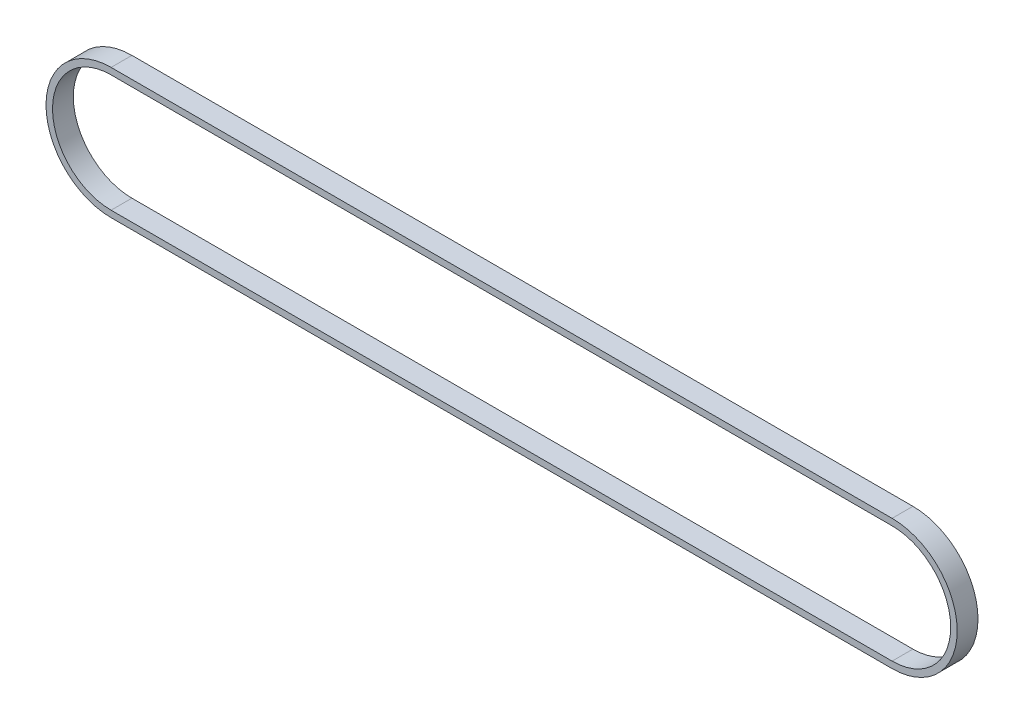
ISO-10303-21;
HEADER;
FILE_DESCRIPTION(('STEP AP214'),'2;1');
FILE_NAME('part.step','',(''),(''),'','','');
FILE_SCHEMA(('AUTOMOTIVE_DESIGN { 1 0 10303 214 1 1 1 1 }'));
ENDSEC;
DATA;
#1=APPLICATION_CONTEXT('core data for automotive mechanical design processes');
#2=APPLICATION_PROTOCOL_DEFINITION('international standard','automotive_design',2000,#1);
#3=PRODUCT_CONTEXT('',#1,'mechanical');
#4=PRODUCT('Part','Part','',(#3));
#5=PRODUCT_RELATED_PRODUCT_CATEGORY('part','',(#4));
#6=PRODUCT_DEFINITION_FORMATION('','',#4);
#7=PRODUCT_DEFINITION_CONTEXT('part definition',#1,'design');
#8=PRODUCT_DEFINITION('design','',#6,#7);
#9=PRODUCT_DEFINITION_SHAPE('','',#8);
#10=(LENGTH_UNIT() NAMED_UNIT(*) SI_UNIT(.MILLI.,.METRE.));
#11=(NAMED_UNIT(*) PLANE_ANGLE_UNIT() SI_UNIT($,.RADIAN.));
#12=(NAMED_UNIT(*) SI_UNIT($,.STERADIAN.) SOLID_ANGLE_UNIT());
#13=UNCERTAINTY_MEASURE_WITH_UNIT(LENGTH_MEASURE(1.E-05),#10,'distance_accuracy_value','');
#14=(GEOMETRIC_REPRESENTATION_CONTEXT(3) GLOBAL_UNCERTAINTY_ASSIGNED_CONTEXT((#13)) GLOBAL_UNIT_ASSIGNED_CONTEXT((#10,
#11,#12)) REPRESENTATION_CONTEXT('',''));
#15=CARTESIAN_POINT('',(0.,0.,0.));
#16=DIRECTION('',(0.,0.,1.));
#17=DIRECTION('',(1.,0.,0.));
#18=AXIS2_PLACEMENT_3D('',#15,#16,#17);
#19=CARTESIAN_POINT('',(-75.,0.,2.));
#20=DIRECTION('',(0.,0.,1.));
#21=DIRECTION('',(1.,0.,0.));
#22=AXIS2_PLACEMENT_3D('',#19,#20,#21);
#23=PLANE('',#22);
#24=CARTESIAN_POINT('',(-75.,0.,2.));
#25=DIRECTION('',(0.,0.,1.));
#26=DIRECTION('',(1.,0.,0.));
#27=AXIS2_PLACEMENT_3D('',#24,#25,#26);
#28=CIRCLE('',#27,12.5);
#29=CARTESIAN_POINT('',(-75.,12.5,2.));
#30=VERTEX_POINT('',#29);
#31=CARTESIAN_POINT('',(-75.,-12.5,2.));
#32=VERTEX_POINT('',#31);
#33=EDGE_CURVE('E136',#30,#32,#28,.T.);
#34=ORIENTED_EDGE('',*,*,#33,.T.);
#35=DIRECTION('',(1.,0.,0.));
#36=VECTOR('',#35,1.);
#37=CARTESIAN_POINT('',(-75.,-12.5,2.));
#38=LINE('',#37,#36);
#39=CARTESIAN_POINT('',(75.,-12.5,2.));
#40=VERTEX_POINT('',#39);
#41=EDGE_CURVE('E139',#32,#40,#38,.T.);
#42=ORIENTED_EDGE('',*,*,#41,.T.);
#43=CARTESIAN_POINT('',(75.,0.,2.));
#44=DIRECTION('',(0.,0.,1.));
#45=DIRECTION('',(1.,0.,0.));
#46=AXIS2_PLACEMENT_3D('',#43,#44,#45);
#47=CIRCLE('',#46,12.5);
#48=CARTESIAN_POINT('',(75.,12.5000000000001,2.));
#49=VERTEX_POINT('',#48);
#50=EDGE_CURVE('E142',#40,#49,#47,.T.);
#51=ORIENTED_EDGE('',*,*,#50,.T.);
#52=DIRECTION('',(-1.,0.,0.));
#53=VECTOR('',#52,1.);
#54=CARTESIAN_POINT('',(-75.,12.5,2.));
#55=LINE('',#54,#53);
#56=EDGE_CURVE('E144',#49,#30,#55,.T.);
#57=ORIENTED_EDGE('',*,*,#56,.T.);
#58=EDGE_LOOP('',(#34,#42,#51,#57));
#59=FACE_BOUND('',#58,.T.);
#60=DIRECTION('',(1.,0.,0.));
#61=VECTOR('',#60,1.);
#62=CARTESIAN_POINT('',(-75.,-11.25,2.));
#63=LINE('',#62,#61);
#64=CARTESIAN_POINT('',(-75.,-11.25,2.));
#65=VERTEX_POINT('',#64);
#66=CARTESIAN_POINT('',(75.,-11.25,2.));
#67=VERTEX_POINT('',#66);
#68=EDGE_CURVE('E108',#65,#67,#63,.T.);
#69=ORIENTED_EDGE('',*,*,#68,.F.);
#70=CARTESIAN_POINT('',(-75.,0.,2.));
#71=DIRECTION('',(0.,0.,1.));
#72=DIRECTION('',(1.,0.,0.));
#73=AXIS2_PLACEMENT_3D('',#70,#71,#72);
#74=CIRCLE('',#73,11.25);
#75=CARTESIAN_POINT('',(-75.,11.25,2.));
#76=VERTEX_POINT('',#75);
#77=EDGE_CURVE('E100',#76,#65,#74,.T.);
#78=ORIENTED_EDGE('',*,*,#77,.F.);
#79=DIRECTION('',(-1.,0.,0.));
#80=VECTOR('',#79,1.);
#81=CARTESIAN_POINT('',(-75.,11.25,2.));
#82=LINE('',#81,#80);
#83=CARTESIAN_POINT('',(75.,11.25,2.));
#84=VERTEX_POINT('',#83);
#85=EDGE_CURVE('E122',#84,#76,#82,.T.);
#86=ORIENTED_EDGE('',*,*,#85,.F.);
#87=CARTESIAN_POINT('',(75.,0.,2.));
#88=DIRECTION('',(0.,0.,1.));
#89=DIRECTION('',(1.,0.,0.));
#90=AXIS2_PLACEMENT_3D('',#87,#88,#89);
#91=CIRCLE('',#90,11.25);
#92=EDGE_CURVE('E120',#67,#84,#91,.T.);
#93=ORIENTED_EDGE('',*,*,#92,.F.);
#94=EDGE_LOOP('',(#69,#78,#86,#93));
#95=FACE_BOUND('',#94,.T.);
#96=ADVANCED_FACE('F35',(#59,#95),#23,.T.);
#97=CARTESIAN_POINT('',(-75.,0.,-2.));
#98=DIRECTION('',(0.,0.,1.));
#99=DIRECTION('',(1.,0.,0.));
#100=AXIS2_PLACEMENT_3D('',#97,#98,#99);
#101=PLANE('',#100);
#102=CARTESIAN_POINT('',(-75.,0.,-2.));
#103=DIRECTION('',(0.,0.,1.));
#104=DIRECTION('',(1.,0.,0.));
#105=AXIS2_PLACEMENT_3D('',#102,#103,#104);
#106=CIRCLE('',#105,12.5);
#107=CARTESIAN_POINT('',(-75.,12.5,-2.));
#108=VERTEX_POINT('',#107);
#109=CARTESIAN_POINT('',(-75.,-12.5,-2.));
#110=VERTEX_POINT('',#109);
#111=EDGE_CURVE('E116',#108,#110,#106,.T.);
#112=ORIENTED_EDGE('',*,*,#111,.F.);
#113=DIRECTION('',(-1.,0.,0.));
#114=VECTOR('',#113,1.);
#115=CARTESIAN_POINT('',(-75.,12.5,-2.));
#116=LINE('',#115,#114);
#117=CARTESIAN_POINT('',(75.,12.5000000000001,-2.));
#118=VERTEX_POINT('',#117);
#119=EDGE_CURVE('E140',#118,#108,#116,.T.);
#120=ORIENTED_EDGE('',*,*,#119,.F.);
#121=CARTESIAN_POINT('',(75.,0.,-2.));
#122=DIRECTION('',(0.,0.,1.));
#123=DIRECTION('',(1.,0.,0.));
#124=AXIS2_PLACEMENT_3D('',#121,#122,#123);
#125=CIRCLE('',#124,12.5);
#126=CARTESIAN_POINT('',(75.,-12.5,-2.));
#127=VERTEX_POINT('',#126);
#128=EDGE_CURVE('E151',#127,#118,#125,.T.);
#129=ORIENTED_EDGE('',*,*,#128,.F.);
#130=DIRECTION('',(1.,0.,0.));
#131=VECTOR('',#130,1.);
#132=CARTESIAN_POINT('',(-75.,-12.5,-2.));
#133=LINE('',#132,#131);
#134=EDGE_CURVE('E149',#110,#127,#133,.T.);
#135=ORIENTED_EDGE('',*,*,#134,.F.);
#136=EDGE_LOOP('',(#112,#120,#129,#135));
#137=FACE_BOUND('',#136,.T.);
#138=CARTESIAN_POINT('',(-75.,0.,-2.));
#139=DIRECTION('',(0.,0.,1.));
#140=DIRECTION('',(1.,0.,0.));
#141=AXIS2_PLACEMENT_3D('',#138,#139,#140);
#142=CIRCLE('',#141,11.25);
#143=CARTESIAN_POINT('',(-75.,11.25,-2.));
#144=VERTEX_POINT('',#143);
#145=CARTESIAN_POINT('',(-75.,-11.25,-2.));
#146=VERTEX_POINT('',#145);
#147=EDGE_CURVE('E58',#144,#146,#142,.T.);
#148=ORIENTED_EDGE('',*,*,#147,.T.);
#149=DIRECTION('',(1.,0.,0.));
#150=VECTOR('',#149,1.);
#151=CARTESIAN_POINT('',(-75.,-11.25,-2.));
#152=LINE('',#151,#150);
#153=CARTESIAN_POINT('',(75.,-11.25,-2.));
#154=VERTEX_POINT('',#153);
#155=EDGE_CURVE('E115',#146,#154,#152,.T.);
#156=ORIENTED_EDGE('',*,*,#155,.T.);
#157=CARTESIAN_POINT('',(75.,0.,-2.));
#158=DIRECTION('',(0.,0.,1.));
#159=DIRECTION('',(1.,0.,0.));
#160=AXIS2_PLACEMENT_3D('',#157,#158,#159);
#161=CIRCLE('',#160,11.25);
#162=CARTESIAN_POINT('',(75.,11.25,-2.));
#163=VERTEX_POINT('',#162);
#164=EDGE_CURVE('E128',#154,#163,#161,.T.);
#165=ORIENTED_EDGE('',*,*,#164,.T.);
#166=DIRECTION('',(-1.,0.,0.));
#167=VECTOR('',#166,1.);
#168=CARTESIAN_POINT('',(-75.,11.25,-2.));
#169=LINE('',#168,#167);
#170=EDGE_CURVE('E109',#163,#144,#169,.T.);
#171=ORIENTED_EDGE('',*,*,#170,.T.);
#172=EDGE_LOOP('',(#148,#156,#165,#171));
#173=FACE_BOUND('',#172,.T.);
#174=ADVANCED_FACE('F169',(#137,#173),#101,.F.);
#175=CARTESIAN_POINT('',(-75.,0.,2.));
#176=DIRECTION('',(0.,0.,-1.));
#177=DIRECTION('',(-1.,0.,0.));
#178=AXIS2_PLACEMENT_3D('',#175,#176,#177);
#179=CYLINDRICAL_SURFACE('',#178,12.5);
#180=ORIENTED_EDGE('',*,*,#111,.T.);
#181=DIRECTION('',(0.,0.,-1.));
#182=VECTOR('',#181,1.);
#183=CARTESIAN_POINT('',(-75.,-12.5,2.));
#184=LINE('',#183,#182);
#185=EDGE_CURVE('E11',#32,#110,#184,.T.);
#186=ORIENTED_EDGE('',*,*,#185,.F.);
#187=ORIENTED_EDGE('',*,*,#33,.F.);
#188=DIRECTION('',(0.,0.,-1.));
#189=VECTOR('',#188,1.);
#190=CARTESIAN_POINT('',(-75.,12.5,2.));
#191=LINE('',#190,#189);
#192=EDGE_CURVE('E146',#30,#108,#191,.T.);
#193=ORIENTED_EDGE('',*,*,#192,.T.);
#194=EDGE_LOOP('',(#180,#186,#187,#193));
#195=FACE_BOUND('',#194,.T.);
#196=ADVANCED_FACE('F37',(#195),#179,.T.);
#197=CARTESIAN_POINT('',(-75.,-12.5,2.));
#198=DIRECTION('',(0.,1.,0.));
#199=DIRECTION('',(-1.,0.,0.));
#200=AXIS2_PLACEMENT_3D('',#197,#198,#199);
#201=PLANE('',#200);
#202=ORIENTED_EDGE('',*,*,#134,.T.);
#203=DIRECTION('',(0.,0.,-1.));
#204=VECTOR('',#203,1.);
#205=CARTESIAN_POINT('',(75.,-12.5,2.));
#206=LINE('',#205,#204);
#207=EDGE_CURVE('E43',#40,#127,#206,.T.);
#208=ORIENTED_EDGE('',*,*,#207,.F.);
#209=ORIENTED_EDGE('',*,*,#41,.F.);
#210=ORIENTED_EDGE('',*,*,#185,.T.);
#211=EDGE_LOOP('',(#202,#208,#209,#210));
#212=FACE_BOUND('',#211,.T.);
#213=ADVANCED_FACE('F179',(#212),#201,.F.);
#214=CARTESIAN_POINT('',(75.,0.,2.));
#215=DIRECTION('',(0.,0.,-1.));
#216=DIRECTION('',(-1.,0.,0.));
#217=AXIS2_PLACEMENT_3D('',#214,#215,#216);
#218=CYLINDRICAL_SURFACE('',#217,12.5);
#219=ORIENTED_EDGE('',*,*,#128,.T.);
#220=DIRECTION('',(0.,0.,-1.));
#221=VECTOR('',#220,1.);
#222=CARTESIAN_POINT('',(75.,12.5000000000001,2.));
#223=LINE('',#222,#221);
#224=EDGE_CURVE('E156',#49,#118,#223,.T.);
#225=ORIENTED_EDGE('',*,*,#224,.F.);
#226=ORIENTED_EDGE('',*,*,#50,.F.);
#227=ORIENTED_EDGE('',*,*,#207,.T.);
#228=EDGE_LOOP('',(#219,#225,#226,#227));
#229=FACE_BOUND('',#228,.T.);
#230=ADVANCED_FACE('F163',(#229),#218,.T.);
#231=CARTESIAN_POINT('',(-75.,12.5,2.));
#232=DIRECTION('',(0.,-1.,0.));
#233=DIRECTION('',(1.,0.,0.));
#234=AXIS2_PLACEMENT_3D('',#231,#232,#233);
#235=PLANE('',#234);
#236=ORIENTED_EDGE('',*,*,#119,.T.);
#237=ORIENTED_EDGE('',*,*,#192,.F.);
#238=ORIENTED_EDGE('',*,*,#56,.F.);
#239=ORIENTED_EDGE('',*,*,#224,.T.);
#240=EDGE_LOOP('',(#236,#237,#238,#239));
#241=FACE_BOUND('',#240,.T.);
#242=ADVANCED_FACE('F173',(#241),#235,.F.);
#243=CARTESIAN_POINT('',(-75.,0.,2.));
#244=DIRECTION('',(0.,0.,-1.));
#245=DIRECTION('',(-1.,0.,0.));
#246=AXIS2_PLACEMENT_3D('',#243,#244,#245);
#247=CYLINDRICAL_SURFACE('',#246,11.25);
#248=ORIENTED_EDGE('',*,*,#147,.F.);
#249=DIRECTION('',(0.,0.,-1.));
#250=VECTOR('',#249,1.);
#251=CARTESIAN_POINT('',(-75.,11.25,2.));
#252=LINE('',#251,#250);
#253=EDGE_CURVE('E104',#76,#144,#252,.T.);
#254=ORIENTED_EDGE('',*,*,#253,.F.);
#255=ORIENTED_EDGE('',*,*,#77,.T.);
#256=DIRECTION('',(0.,0.,-1.));
#257=VECTOR('',#256,1.);
#258=CARTESIAN_POINT('',(-75.,-11.25,2.));
#259=LINE('',#258,#257);
#260=EDGE_CURVE('E103',#65,#146,#259,.T.);
#261=ORIENTED_EDGE('',*,*,#260,.T.);
#262=EDGE_LOOP('',(#248,#254,#255,#261));
#263=FACE_BOUND('',#262,.T.);
#264=ADVANCED_FACE('F102',(#263),#247,.F.);
#265=CARTESIAN_POINT('',(-75.,-11.25,2.));
#266=DIRECTION('',(0.,1.,0.));
#267=DIRECTION('',(-1.,0.,0.));
#268=AXIS2_PLACEMENT_3D('',#265,#266,#267);
#269=PLANE('',#268);
#270=ORIENTED_EDGE('',*,*,#155,.F.);
#271=ORIENTED_EDGE('',*,*,#260,.F.);
#272=ORIENTED_EDGE('',*,*,#68,.T.);
#273=DIRECTION('',(0.,0.,-1.));
#274=VECTOR('',#273,1.);
#275=CARTESIAN_POINT('',(75.,-11.25,2.));
#276=LINE('',#275,#274);
#277=EDGE_CURVE('E117',#67,#154,#276,.T.);
#278=ORIENTED_EDGE('',*,*,#277,.T.);
#279=EDGE_LOOP('',(#270,#271,#272,#278));
#280=FACE_BOUND('',#279,.T.);
#281=ADVANCED_FACE('F112',(#280),#269,.T.);
#282=CARTESIAN_POINT('',(75.,0.,2.));
#283=DIRECTION('',(0.,0.,-1.));
#284=DIRECTION('',(-1.,0.,0.));
#285=AXIS2_PLACEMENT_3D('',#282,#283,#284);
#286=CYLINDRICAL_SURFACE('',#285,11.25);
#287=ORIENTED_EDGE('',*,*,#164,.F.);
#288=ORIENTED_EDGE('',*,*,#277,.F.);
#289=ORIENTED_EDGE('',*,*,#92,.T.);
#290=DIRECTION('',(0.,0.,-1.));
#291=VECTOR('',#290,1.);
#292=CARTESIAN_POINT('',(75.,11.25,2.));
#293=LINE('',#292,#291);
#294=EDGE_CURVE('E50',#84,#163,#293,.T.);
#295=ORIENTED_EDGE('',*,*,#294,.T.);
#296=EDGE_LOOP('',(#287,#288,#289,#295));
#297=FACE_BOUND('',#296,.T.);
#298=ADVANCED_FACE('F202',(#297),#286,.F.);
#299=CARTESIAN_POINT('',(-75.,11.25,2.));
#300=DIRECTION('',(0.,-1.,0.));
#301=DIRECTION('',(0.,0.,-1.));
#302=AXIS2_PLACEMENT_3D('',#299,#300,#301);
#303=PLANE('',#302);
#304=ORIENTED_EDGE('',*,*,#170,.F.);
#305=ORIENTED_EDGE('',*,*,#294,.F.);
#306=ORIENTED_EDGE('',*,*,#85,.T.);
#307=ORIENTED_EDGE('',*,*,#253,.T.);
#308=EDGE_LOOP('',(#304,#305,#306,#307));
#309=FACE_BOUND('',#308,.T.);
#310=ADVANCED_FACE('F206',(#309),#303,.T.);
#311=CLOSED_SHELL('',(#96,#174,#196,#213,#230,#242,#264,#281,#298,#310));
#312=MANIFOLD_SOLID_BREP('B2',#311);
#313=ADVANCED_BREP_SHAPE_REPRESENTATION('',(#18,#312),#14);
#314=SHAPE_DEFINITION_REPRESENTATION(#9,#313);
ENDSEC;
END-ISO-10303-21;
